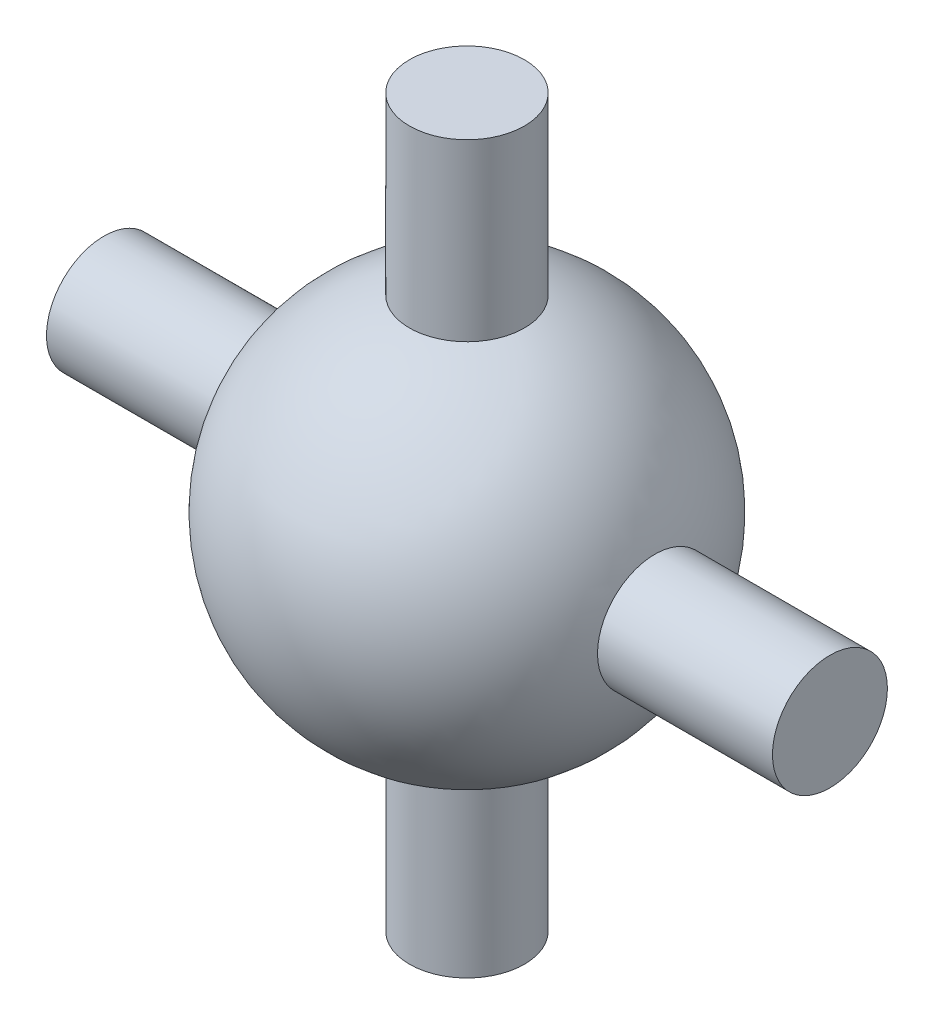
ISO-10303-21;
HEADER;
FILE_DESCRIPTION(('STEP AP214'),'2;1');
FILE_NAME('part.step','',(''),(''),'','','');
FILE_SCHEMA(('AUTOMOTIVE_DESIGN { 1 0 10303 214 1 1 1 1 }'));
ENDSEC;
DATA;
#1=APPLICATION_CONTEXT('core data for automotive mechanical design processes');
#2=APPLICATION_PROTOCOL_DEFINITION('international standard','automotive_design',2000,#1);
#3=PRODUCT_CONTEXT('',#1,'mechanical');
#4=PRODUCT('Part','Part','',(#3));
#5=PRODUCT_RELATED_PRODUCT_CATEGORY('part','',(#4));
#6=PRODUCT_DEFINITION_FORMATION('','',#4);
#7=PRODUCT_DEFINITION_CONTEXT('part definition',#1,'design');
#8=PRODUCT_DEFINITION('design','',#6,#7);
#9=PRODUCT_DEFINITION_SHAPE('','',#8);
#10=(LENGTH_UNIT() NAMED_UNIT(*) SI_UNIT(.MILLI.,.METRE.));
#11=(NAMED_UNIT(*) PLANE_ANGLE_UNIT() SI_UNIT($,.RADIAN.));
#12=(NAMED_UNIT(*) SI_UNIT($,.STERADIAN.) SOLID_ANGLE_UNIT());
#13=UNCERTAINTY_MEASURE_WITH_UNIT(LENGTH_MEASURE(1.E-05),#10,'distance_accuracy_value','');
#14=(GEOMETRIC_REPRESENTATION_CONTEXT(3) GLOBAL_UNCERTAINTY_ASSIGNED_CONTEXT((#13)) GLOBAL_UNIT_ASSIGNED_CONTEXT((#10,
#11,#12)) REPRESENTATION_CONTEXT('',''));
#15=CARTESIAN_POINT('',(0.,0.,0.));
#16=DIRECTION('',(0.,0.,1.));
#17=DIRECTION('',(1.,0.,0.));
#18=AXIS2_PLACEMENT_3D('',#15,#16,#17);
#19=CARTESIAN_POINT('',(0.,0.,0.));
#20=DIRECTION('',(0.,-1.,0.));
#21=DIRECTION('',(-1.,0.,0.));
#22=AXIS2_PLACEMENT_3D('',#19,#20,#21);
#23=SPHERICAL_SURFACE('',#22,3.25);
#24=CARTESIAN_POINT('',(3.10805405358401,0.,0.));
#25=DIRECTION('',(-1.,0.,0.));
#26=DIRECTION('',(0.,0.,1.));
#27=AXIS2_PLACEMENT_3D('',#24,#25,#26);
#28=CIRCLE('',#27,0.95);
#29=CARTESIAN_POINT('',(3.10805405358401,0.,0.95));
#30=VERTEX_POINT('',#29);
#31=EDGE_CURVE('E29',#30,#30,#28,.T.);
#32=ORIENTED_EDGE('',*,*,#31,.T.);
#33=EDGE_LOOP('',(#32));
#34=FACE_BOUND('',#33,.T.);
#35=CARTESIAN_POINT('',(0.,3.10805405358401,0.));
#36=DIRECTION('',(0.,-1.,0.));
#37=DIRECTION('',(0.,0.,-1.));
#38=AXIS2_PLACEMENT_3D('',#35,#36,#37);
#39=CIRCLE('',#38,0.95);
#40=CARTESIAN_POINT('',(0.,3.10805405358401,-0.95));
#41=VERTEX_POINT('',#40);
#42=EDGE_CURVE('E21',#41,#41,#39,.T.);
#43=ORIENTED_EDGE('',*,*,#42,.T.);
#44=EDGE_LOOP('',(#43));
#45=FACE_BOUND('',#44,.T.);
#46=CARTESIAN_POINT('',(0.,-3.10805405358401,0.));
#47=DIRECTION('',(0.,1.,0.));
#48=DIRECTION('',(0.,0.,1.));
#49=AXIS2_PLACEMENT_3D('',#46,#47,#48);
#50=CIRCLE('',#49,0.95);
#51=CARTESIAN_POINT('',(0.,-3.10805405358401,0.95));
#52=VERTEX_POINT('',#51);
#53=EDGE_CURVE('E10',#52,#52,#50,.T.);
#54=ORIENTED_EDGE('',*,*,#53,.T.);
#55=EDGE_LOOP('',(#54));
#56=FACE_BOUND('',#55,.T.);
#57=CARTESIAN_POINT('',(-3.10805405358401,0.,0.));
#58=DIRECTION('',(1.,0.,0.));
#59=DIRECTION('',(0.,0.,-1.));
#60=AXIS2_PLACEMENT_3D('',#57,#58,#59);
#61=CIRCLE('',#60,0.95);
#62=CARTESIAN_POINT('',(-3.10805405358401,0.,-0.95));
#63=VERTEX_POINT('',#62);
#64=EDGE_CURVE('E17',#63,#63,#61,.T.);
#65=ORIENTED_EDGE('',*,*,#64,.T.);
#66=EDGE_LOOP('',(#65));
#67=FACE_BOUND('',#66,.T.);
#68=ADVANCED_FACE('F14',(#34,#45,#56,#67),#23,.T.);
#69=CARTESIAN_POINT('',(0.,6.,0.));
#70=DIRECTION('',(0.,-1.,0.));
#71=DIRECTION('',(0.,0.,-1.));
#72=AXIS2_PLACEMENT_3D('',#69,#70,#71);
#73=CYLINDRICAL_SURFACE('',#72,0.95);
#74=ORIENTED_EDGE('',*,*,#53,.F.);
#75=EDGE_LOOP('',(#74));
#76=FACE_BOUND('',#75,.T.);
#77=CARTESIAN_POINT('',(0.,-6.,0.));
#78=DIRECTION('',(0.,1.,0.));
#79=DIRECTION('',(0.,0.,1.));
#80=AXIS2_PLACEMENT_3D('',#77,#78,#79);
#81=CIRCLE('',#80,0.95);
#82=CARTESIAN_POINT('',(0.,-6.,0.95));
#83=VERTEX_POINT('',#82);
#84=EDGE_CURVE('E35',#83,#83,#81,.T.);
#85=ORIENTED_EDGE('',*,*,#84,.T.);
#86=EDGE_LOOP('',(#85));
#87=FACE_BOUND('',#86,.T.);
#88=ADVANCED_FACE('F48',(#76,#87),#73,.T.);
#89=CARTESIAN_POINT('',(0.,-6.,0.));
#90=DIRECTION('',(0.,1.,0.));
#91=DIRECTION('',(0.,0.,1.));
#92=AXIS2_PLACEMENT_3D('',#89,#90,#91);
#93=PLANE('',#92);
#94=ORIENTED_EDGE('',*,*,#84,.F.);
#95=EDGE_LOOP('',(#94));
#96=FACE_BOUND('',#95,.T.);
#97=ADVANCED_FACE('F50',(#96),#93,.F.);
#98=CARTESIAN_POINT('',(0.,6.,0.));
#99=DIRECTION('',(0.,1.,0.));
#100=DIRECTION('',(0.,0.,1.));
#101=AXIS2_PLACEMENT_3D('',#98,#99,#100);
#102=PLANE('',#101);
#103=CARTESIAN_POINT('',(0.,6.,0.));
#104=DIRECTION('',(0.,1.,0.));
#105=DIRECTION('',(0.,0.,1.));
#106=AXIS2_PLACEMENT_3D('',#103,#104,#105);
#107=CIRCLE('',#106,0.95);
#108=CARTESIAN_POINT('',(0.,6.,0.95));
#109=VERTEX_POINT('',#108);
#110=EDGE_CURVE('E26',#109,#109,#107,.T.);
#111=ORIENTED_EDGE('',*,*,#110,.T.);
#112=EDGE_LOOP('',(#111));
#113=FACE_BOUND('',#112,.T.);
#114=ADVANCED_FACE('F52',(#113),#102,.T.);
#115=ORIENTED_EDGE('',*,*,#42,.F.);
#116=EDGE_LOOP('',(#115));
#117=FACE_BOUND('',#116,.T.);
#118=ORIENTED_EDGE('',*,*,#110,.F.);
#119=EDGE_LOOP('',(#118));
#120=FACE_BOUND('',#119,.T.);
#121=ADVANCED_FACE('F59',(#117,#120),#73,.T.);
#122=CARTESIAN_POINT('',(6.,0.,0.));
#123=DIRECTION('',(1.,0.,0.));
#124=DIRECTION('',(0.,0.,-1.));
#125=AXIS2_PLACEMENT_3D('',#122,#123,#124);
#126=PLANE('',#125);
#127=CARTESIAN_POINT('',(6.,0.,0.));
#128=DIRECTION('',(1.,0.,0.));
#129=DIRECTION('',(0.,0.,-1.));
#130=AXIS2_PLACEMENT_3D('',#127,#128,#129);
#131=CIRCLE('',#130,0.95);
#132=CARTESIAN_POINT('',(6.,0.,-0.95));
#133=VERTEX_POINT('',#132);
#134=EDGE_CURVE('E31',#133,#133,#131,.T.);
#135=ORIENTED_EDGE('',*,*,#134,.T.);
#136=EDGE_LOOP('',(#135));
#137=FACE_BOUND('',#136,.T.);
#138=ADVANCED_FACE('F84',(#137),#126,.T.);
#139=CARTESIAN_POINT('',(6.,0.,0.));
#140=DIRECTION('',(-1.,0.,0.));
#141=DIRECTION('',(0.,0.,1.));
#142=AXIS2_PLACEMENT_3D('',#139,#140,#141);
#143=CYLINDRICAL_SURFACE('',#142,0.95);
#144=ORIENTED_EDGE('',*,*,#31,.F.);
#145=EDGE_LOOP('',(#144));
#146=FACE_BOUND('',#145,.T.);
#147=ORIENTED_EDGE('',*,*,#134,.F.);
#148=EDGE_LOOP('',(#147));
#149=FACE_BOUND('',#148,.T.);
#150=ADVANCED_FACE('F75',(#146,#149),#143,.T.);
#151=ORIENTED_EDGE('',*,*,#64,.F.);
#152=EDGE_LOOP('',(#151));
#153=FACE_BOUND('',#152,.T.);
#154=CARTESIAN_POINT('',(-6.,0.,0.));
#155=DIRECTION('',(1.,0.,0.));
#156=DIRECTION('',(0.,0.,-1.));
#157=AXIS2_PLACEMENT_3D('',#154,#155,#156);
#158=CIRCLE('',#157,0.95);
#159=CARTESIAN_POINT('',(-6.,0.,-0.95));
#160=VERTEX_POINT('',#159);
#161=EDGE_CURVE('E37',#160,#160,#158,.T.);
#162=ORIENTED_EDGE('',*,*,#161,.T.);
#163=EDGE_LOOP('',(#162));
#164=FACE_BOUND('',#163,.T.);
#165=ADVANCED_FACE('F71',(#153,#164),#143,.T.);
#166=CARTESIAN_POINT('',(-6.,0.,0.));
#167=DIRECTION('',(1.,0.,0.));
#168=DIRECTION('',(0.,0.,-1.));
#169=AXIS2_PLACEMENT_3D('',#166,#167,#168);
#170=PLANE('',#169);
#171=ORIENTED_EDGE('',*,*,#161,.F.);
#172=EDGE_LOOP('',(#171));
#173=FACE_BOUND('',#172,.T.);
#174=ADVANCED_FACE('F74',(#173),#170,.F.);
#175=CLOSED_SHELL('',(#68,#88,#97,#114,#121,#138,#150,#165,#174));
#176=MANIFOLD_SOLID_BREP('B1',#175);
#177=ADVANCED_BREP_SHAPE_REPRESENTATION('',(#18,#176),#14);
#178=SHAPE_DEFINITION_REPRESENTATION(#9,#177);
ENDSEC;
END-ISO-10303-21;
